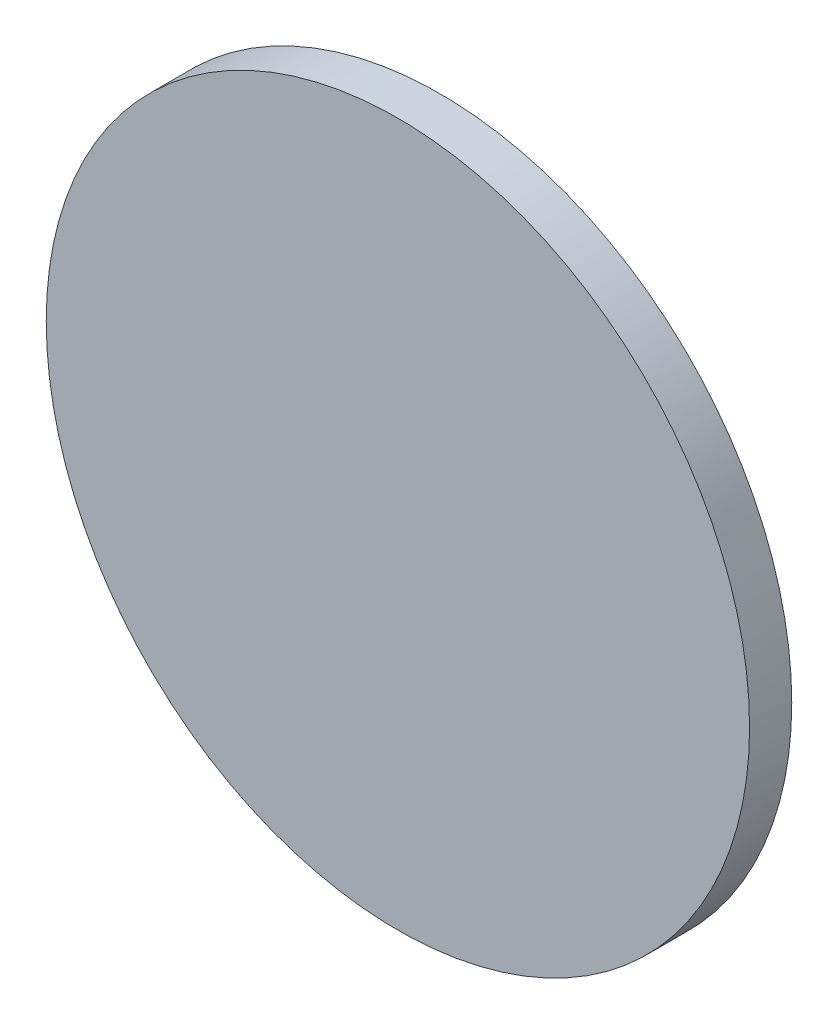
ISO-10303-21;
HEADER;
FILE_DESCRIPTION(('STEP AP214'),'2;1');
FILE_NAME('part.step','',(''),(''),'','','');
FILE_SCHEMA(('AUTOMOTIVE_DESIGN { 1 0 10303 214 1 1 1 1 }'));
ENDSEC;
DATA;
#1=APPLICATION_CONTEXT('core data for automotive mechanical design processes');
#2=APPLICATION_PROTOCOL_DEFINITION('international standard','automotive_design',2000,#1);
#3=PRODUCT_CONTEXT('',#1,'mechanical');
#4=PRODUCT('Part','Part','',(#3));
#5=PRODUCT_RELATED_PRODUCT_CATEGORY('part','',(#4));
#6=PRODUCT_DEFINITION_FORMATION('','',#4);
#7=PRODUCT_DEFINITION_CONTEXT('part definition',#1,'design');
#8=PRODUCT_DEFINITION('design','',#6,#7);
#9=PRODUCT_DEFINITION_SHAPE('','',#8);
#10=(LENGTH_UNIT() NAMED_UNIT(*) SI_UNIT(.MILLI.,.METRE.));
#11=(NAMED_UNIT(*) PLANE_ANGLE_UNIT() SI_UNIT($,.RADIAN.));
#12=(NAMED_UNIT(*) SI_UNIT($,.STERADIAN.) SOLID_ANGLE_UNIT());
#13=UNCERTAINTY_MEASURE_WITH_UNIT(LENGTH_MEASURE(1.E-05),#10,'distance_accuracy_value','');
#14=(GEOMETRIC_REPRESENTATION_CONTEXT(3) GLOBAL_UNCERTAINTY_ASSIGNED_CONTEXT((#13)) GLOBAL_UNIT_ASSIGNED_CONTEXT((#10,
#11,#12)) REPRESENTATION_CONTEXT('',''));
#15=CARTESIAN_POINT('',(0.,0.,0.));
#16=DIRECTION('',(0.,0.,1.));
#17=DIRECTION('',(1.,0.,0.));
#18=AXIS2_PLACEMENT_3D('',#15,#16,#17);
#19=CARTESIAN_POINT('',(0.,0.,2.667));
#20=DIRECTION('',(0.,0.,-1.));
#21=DIRECTION('',(-1.,0.,0.));
#22=AXIS2_PLACEMENT_3D('',#19,#20,#21);
#23=CYLINDRICAL_SURFACE('',#22,44.45);
#24=CARTESIAN_POINT('',(0.,0.,2.667));
#25=DIRECTION('',(0.,0.,1.));
#26=DIRECTION('',(1.,0.,0.));
#27=AXIS2_PLACEMENT_3D('',#24,#25,#26);
#28=CIRCLE('',#27,44.45);
#29=CARTESIAN_POINT('',(44.45,0.,2.667));
#30=VERTEX_POINT('',#29);
#31=EDGE_CURVE('E10',#30,#30,#28,.T.);
#32=ORIENTED_EDGE('',*,*,#31,.F.);
#33=EDGE_LOOP('',(#32));
#34=FACE_BOUND('',#33,.T.);
#35=CARTESIAN_POINT('',(0.,0.,-2.667));
#36=DIRECTION('',(0.,0.,1.));
#37=DIRECTION('',(1.,0.,0.));
#38=AXIS2_PLACEMENT_3D('',#35,#36,#37);
#39=CIRCLE('',#38,44.45);
#40=CARTESIAN_POINT('',(44.45,0.,-2.667));
#41=VERTEX_POINT('',#40);
#42=EDGE_CURVE('E34',#41,#41,#39,.T.);
#43=ORIENTED_EDGE('',*,*,#42,.T.);
#44=EDGE_LOOP('',(#43));
#45=FACE_BOUND('',#44,.T.);
#46=ADVANCED_FACE('F31',(#34,#45),#23,.T.);
#47=CARTESIAN_POINT('',(0.,0.,2.667));
#48=DIRECTION('',(0.,0.,1.));
#49=DIRECTION('',(1.,0.,0.));
#50=AXIS2_PLACEMENT_3D('',#47,#48,#49);
#51=PLANE('',#50);
#52=ORIENTED_EDGE('',*,*,#31,.T.);
#53=EDGE_LOOP('',(#52));
#54=FACE_BOUND('',#53,.T.);
#55=ADVANCED_FACE('F46',(#54),#51,.T.);
#56=CARTESIAN_POINT('',(0.,0.,-2.667));
#57=DIRECTION('',(0.,0.,1.));
#58=DIRECTION('',(1.,0.,0.));
#59=AXIS2_PLACEMENT_3D('',#56,#57,#58);
#60=PLANE('',#59);
#61=ORIENTED_EDGE('',*,*,#42,.F.);
#62=EDGE_LOOP('',(#61));
#63=FACE_BOUND('',#62,.T.);
#64=ADVANCED_FACE('F44',(#63),#60,.F.);
#65=CLOSED_SHELL('',(#46,#55,#64));
#66=MANIFOLD_SOLID_BREP('B2',#65);
#67=ADVANCED_BREP_SHAPE_REPRESENTATION('',(#18,#66),#14);
#68=SHAPE_DEFINITION_REPRESENTATION(#9,#67);
ENDSEC;
END-ISO-10303-21;
